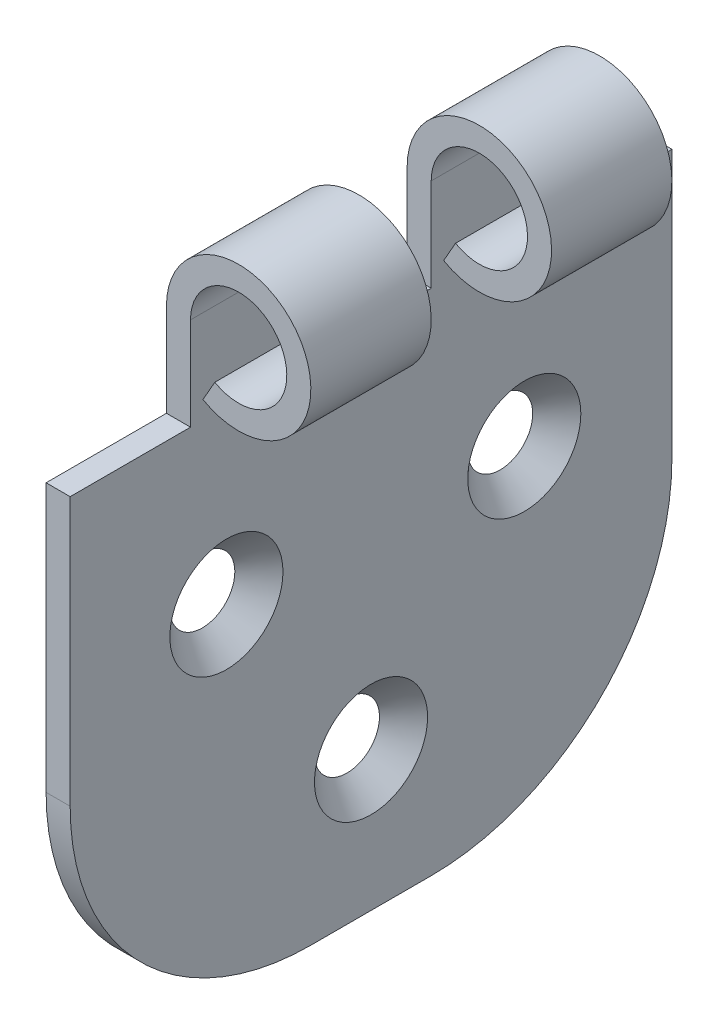
ISO-10303-21;
HEADER;
FILE_DESCRIPTION(('STEP AP214'),'2;1');
FILE_NAME('part.step','',(''),(''),'','','');
FILE_SCHEMA(('AUTOMOTIVE_DESIGN { 1 0 10303 214 1 1 1 1 }'));
ENDSEC;
DATA;
#1=APPLICATION_CONTEXT('core data for automotive mechanical design processes');
#2=APPLICATION_PROTOCOL_DEFINITION('international standard','automotive_design',2000,#1);
#3=PRODUCT_CONTEXT('',#1,'mechanical');
#4=PRODUCT('Part','Part','',(#3));
#5=PRODUCT_RELATED_PRODUCT_CATEGORY('part','',(#4));
#6=PRODUCT_DEFINITION_FORMATION('','',#4);
#7=PRODUCT_DEFINITION_CONTEXT('part definition',#1,'design');
#8=PRODUCT_DEFINITION('design','',#6,#7);
#9=PRODUCT_DEFINITION_SHAPE('','',#8);
#10=(LENGTH_UNIT() NAMED_UNIT(*) SI_UNIT(.MILLI.,.METRE.));
#11=(NAMED_UNIT(*) PLANE_ANGLE_UNIT() SI_UNIT($,.RADIAN.));
#12=(NAMED_UNIT(*) SI_UNIT($,.STERADIAN.) SOLID_ANGLE_UNIT());
#13=UNCERTAINTY_MEASURE_WITH_UNIT(LENGTH_MEASURE(1.E-05),#10,'distance_accuracy_value','');
#14=(GEOMETRIC_REPRESENTATION_CONTEXT(3) GLOBAL_UNCERTAINTY_ASSIGNED_CONTEXT((#13)) GLOBAL_UNIT_ASSIGNED_CONTEXT((#10,
#11,#12)) REPRESENTATION_CONTEXT('',''));
#15=CARTESIAN_POINT('',(0.,0.,0.));
#16=DIRECTION('',(0.,0.,1.));
#17=DIRECTION('',(1.,0.,0.));
#18=AXIS2_PLACEMENT_3D('',#15,#16,#17);
#19=CARTESIAN_POINT('',(1.99999999999999,50.,25.));
#20=DIRECTION('',(-1.,0.,0.));
#21=DIRECTION('',(0.,-1.,0.));
#22=AXIS2_PLACEMENT_3D('',#19,#20,#21);
#23=PLANE('',#22);
#24=CARTESIAN_POINT('',(2.,28.0397626935268,12.0173285585912));
#25=DIRECTION('',(1.,0.,0.));
#26=DIRECTION('',(0.,0.,-1.));
#27=AXIS2_PLACEMENT_3D('',#24,#25,#26);
#28=CIRCLE('',#27,4.7);
#29=CARTESIAN_POINT('',(2.,28.0397626935268,7.3173285585912));
#30=VERTEX_POINT('',#29);
#31=EDGE_CURVE('E304',#30,#30,#28,.T.);
#32=ORIENTED_EDGE('',*,*,#31,.F.);
#33=EDGE_LOOP('',(#32));
#34=FACE_BOUND('',#33,.T.);
#35=CARTESIAN_POINT('',(2.,27.0383186469775,-12.7326457346978));
#36=DIRECTION('',(1.,0.,0.));
#37=DIRECTION('',(0.,0.,-1.));
#38=AXIS2_PLACEMENT_3D('',#35,#36,#37);
#39=CIRCLE('',#38,4.7);
#40=CARTESIAN_POINT('',(2.,27.0383186469775,-17.4326457346978));
#41=VERTEX_POINT('',#40);
#42=EDGE_CURVE('E198',#41,#41,#39,.T.);
#43=ORIENTED_EDGE('',*,*,#42,.F.);
#44=EDGE_LOOP('',(#43));
#45=FACE_BOUND('',#44,.T.);
#46=DIRECTION('',(0.,0.,-1.));
#47=VECTOR('',#46,1.);
#48=CARTESIAN_POINT('',(2.,0.,25.));
#49=LINE('',#48,#47);
#50=CARTESIAN_POINT('',(2.,0.,5.));
#51=VERTEX_POINT('',#50);
#52=CARTESIAN_POINT('',(2.,0.,-5.));
#53=VERTEX_POINT('',#52);
#54=EDGE_CURVE('E279',#51,#53,#49,.T.);
#55=ORIENTED_EDGE('',*,*,#54,.T.);
#56=CARTESIAN_POINT('',(2.,20.,-5.));
#57=DIRECTION('',(-1.,0.,0.));
#58=DIRECTION('',(0.,-1.,0.));
#59=AXIS2_PLACEMENT_3D('',#56,#57,#58);
#60=CIRCLE('',#59,20.);
#61=CARTESIAN_POINT('',(2.,20.,-25.));
#62=VERTEX_POINT('',#61);
#63=EDGE_CURVE('E296',#53,#62,#60,.F.);
#64=ORIENTED_EDGE('',*,*,#63,.T.);
#65=DIRECTION('',(0.,1.,0.));
#66=VECTOR('',#65,1.);
#67=CARTESIAN_POINT('',(1.99999999999999,50.,-25.));
#68=LINE('',#67,#66);
#69=CARTESIAN_POINT('',(1.99999999999999,42.2789868146542,-25.));
#70=VERTEX_POINT('',#69);
#71=EDGE_CURVE('E253',#62,#70,#68,.T.);
#72=ORIENTED_EDGE('',*,*,#71,.T.);
#73=DIRECTION('',(0.,0.,-1.));
#74=VECTOR('',#73,1.);
#75=CARTESIAN_POINT('',(1.99999999999999,42.2789868146542,25.));
#76=LINE('',#75,#74);
#77=CARTESIAN_POINT('',(1.99999999999999,42.2789868146542,-15.));
#78=VERTEX_POINT('',#77);
#79=EDGE_CURVE('E181',#78,#70,#76,.T.);
#80=ORIENTED_EDGE('',*,*,#79,.F.);
#81=DIRECTION('',(0.,-1.,0.));
#82=VECTOR('',#81,1.);
#83=CARTESIAN_POINT('',(1.99999999999999,50.,-15.));
#84=LINE('',#83,#82);
#85=CARTESIAN_POINT('',(1.99999999999999,50.,-15.));
#86=VERTEX_POINT('',#85);
#87=EDGE_CURVE('E226',#86,#78,#84,.T.);
#88=ORIENTED_EDGE('',*,*,#87,.F.);
#89=DIRECTION('',(0.,0.,-1.));
#90=VECTOR('',#89,1.);
#91=CARTESIAN_POINT('',(1.99999999999999,50.,25.));
#92=LINE('',#91,#90);
#93=CARTESIAN_POINT('',(1.99999999999999,50.,-5.));
#94=VERTEX_POINT('',#93);
#95=EDGE_CURVE('E275',#94,#86,#92,.T.);
#96=ORIENTED_EDGE('',*,*,#95,.F.);
#97=DIRECTION('',(0.,1.,0.));
#98=VECTOR('',#97,1.);
#99=CARTESIAN_POINT('',(1.99999999999999,50.,-5.));
#100=LINE('',#99,#98);
#101=CARTESIAN_POINT('',(1.99999999999999,42.2789868146542,-5.));
#102=VERTEX_POINT('',#101);
#103=EDGE_CURVE('E234',#102,#94,#100,.T.);
#104=ORIENTED_EDGE('',*,*,#103,.F.);
#105=DIRECTION('',(0.,0.,-1.));
#106=VECTOR('',#105,1.);
#107=CARTESIAN_POINT('',(1.99999999999999,42.2789868146542,25.));
#108=LINE('',#107,#106);
#109=CARTESIAN_POINT('',(1.99999999999999,42.2789868146542,5.));
#110=VERTEX_POINT('',#109);
#111=EDGE_CURVE('E236',#110,#102,#108,.T.);
#112=ORIENTED_EDGE('',*,*,#111,.F.);
#113=DIRECTION('',(0.,-1.,0.));
#114=VECTOR('',#113,1.);
#115=CARTESIAN_POINT('',(1.99999999999999,50.,5.));
#116=LINE('',#115,#114);
#117=CARTESIAN_POINT('',(1.99999999999999,50.,5.));
#118=VERTEX_POINT('',#117);
#119=EDGE_CURVE('E244',#118,#110,#116,.T.);
#120=ORIENTED_EDGE('',*,*,#119,.F.);
#121=CARTESIAN_POINT('',(1.99999999999999,50.,15.));
#122=VERTEX_POINT('',#121);
#123=EDGE_CURVE('E278',#122,#118,#92,.T.);
#124=ORIENTED_EDGE('',*,*,#123,.F.);
#125=DIRECTION('',(0.,1.,0.));
#126=VECTOR('',#125,1.);
#127=CARTESIAN_POINT('',(1.99999999999999,50.,15.));
#128=LINE('',#127,#126);
#129=CARTESIAN_POINT('',(1.99999999999999,42.2789868146542,15.));
#130=VERTEX_POINT('',#129);
#131=EDGE_CURVE('E251',#130,#122,#128,.T.);
#132=ORIENTED_EDGE('',*,*,#131,.F.);
#133=DIRECTION('',(0.,0.,-1.));
#134=VECTOR('',#133,1.);
#135=CARTESIAN_POINT('',(1.99999999999999,42.2789868146542,25.));
#136=LINE('',#135,#134);
#137=CARTESIAN_POINT('',(2.,42.2789868146542,25.));
#138=VERTEX_POINT('',#137);
#139=EDGE_CURVE('E178',#138,#130,#136,.T.);
#140=ORIENTED_EDGE('',*,*,#139,.F.);
#141=DIRECTION('',(0.,1.,0.));
#142=VECTOR('',#141,1.);
#143=CARTESIAN_POINT('',(1.99999999999999,50.,25.));
#144=LINE('',#143,#142);
#145=CARTESIAN_POINT('',(2.,20.,25.));
#146=VERTEX_POINT('',#145);
#147=EDGE_CURVE('E254',#146,#138,#144,.T.);
#148=ORIENTED_EDGE('',*,*,#147,.F.);
#149=CARTESIAN_POINT('',(2.,20.,5.));
#150=DIRECTION('',(-1.,0.,0.));
#151=DIRECTION('',(0.,-1.,0.));
#152=AXIS2_PLACEMENT_3D('',#149,#150,#151);
#153=CIRCLE('',#152,20.);
#154=EDGE_CURVE('E294',#146,#51,#153,.F.);
#155=ORIENTED_EDGE('',*,*,#154,.T.);
#156=EDGE_LOOP('',(#55,#64,#72,#80,#88,#96,#104,#112,#120,#124,#132,#140,#148,#155));
#157=FACE_BOUND('',#156,.T.);
#158=CARTESIAN_POINT('',(2.,11.5874676430746,0.));
#159=DIRECTION('',(1.,0.,0.));
#160=DIRECTION('',(0.,0.,-1.));
#161=AXIS2_PLACEMENT_3D('',#158,#159,#160);
#162=CIRCLE('',#161,4.7);
#163=CARTESIAN_POINT('',(2.,11.5874676430746,-4.7));
#164=VERTEX_POINT('',#163);
#165=EDGE_CURVE('E312',#164,#164,#162,.T.);
#166=ORIENTED_EDGE('',*,*,#165,.F.);
#167=EDGE_LOOP('',(#166));
#168=FACE_BOUND('',#167,.T.);
#169=ADVANCED_FACE('F40',(#34,#45,#157,#168),#23,.F.);
#170=CARTESIAN_POINT('',(0.,0.,25.));
#171=DIRECTION('',(1.,0.,0.));
#172=DIRECTION('',(0.,0.,-1.));
#173=AXIS2_PLACEMENT_3D('',#170,#171,#172);
#174=PLANE('',#173);
#175=CARTESIAN_POINT('',(0.,11.5874676430746,0.));
#176=DIRECTION('',(1.,0.,0.));
#177=DIRECTION('',(0.,0.,-1.));
#178=AXIS2_PLACEMENT_3D('',#175,#176,#177);
#179=CIRCLE('',#178,2.7);
#180=CARTESIAN_POINT('',(0.,11.5874676430746,-2.7));
#181=VERTEX_POINT('',#180);
#182=EDGE_CURVE('E44',#181,#181,#179,.T.);
#183=ORIENTED_EDGE('',*,*,#182,.T.);
#184=EDGE_LOOP('',(#183));
#185=FACE_BOUND('',#184,.T.);
#186=CARTESIAN_POINT('',(0.,28.0397626935268,12.0173285585912));
#187=DIRECTION('',(1.,0.,0.));
#188=DIRECTION('',(0.,0.,-1.));
#189=AXIS2_PLACEMENT_3D('',#186,#187,#188);
#190=CIRCLE('',#189,2.7);
#191=CARTESIAN_POINT('',(0.,28.0397626935268,9.3173285585912));
#192=VERTEX_POINT('',#191);
#193=EDGE_CURVE('E302',#192,#192,#190,.T.);
#194=ORIENTED_EDGE('',*,*,#193,.T.);
#195=EDGE_LOOP('',(#194));
#196=FACE_BOUND('',#195,.T.);
#197=CARTESIAN_POINT('',(0.,27.0383186469775,-12.7326457346978));
#198=DIRECTION('',(1.,0.,0.));
#199=DIRECTION('',(0.,0.,-1.));
#200=AXIS2_PLACEMENT_3D('',#197,#198,#199);
#201=CIRCLE('',#200,2.7);
#202=CARTESIAN_POINT('',(0.,27.0383186469775,-15.4326457346978));
#203=VERTEX_POINT('',#202);
#204=EDGE_CURVE('E213',#203,#203,#201,.T.);
#205=ORIENTED_EDGE('',*,*,#204,.T.);
#206=EDGE_LOOP('',(#205));
#207=FACE_BOUND('',#206,.T.);
#208=DIRECTION('',(0.,-1.,0.));
#209=VECTOR('',#208,1.);
#210=CARTESIAN_POINT('',(0.,0.,-25.));
#211=LINE('',#210,#209);
#212=CARTESIAN_POINT('',(0.,42.2789868146542,-25.));
#213=VERTEX_POINT('',#212);
#214=CARTESIAN_POINT('',(0.,20.,-25.));
#215=VERTEX_POINT('',#214);
#216=EDGE_CURVE('E256',#213,#215,#211,.T.);
#217=ORIENTED_EDGE('',*,*,#216,.T.);
#218=CARTESIAN_POINT('',(0.,20.,-5.));
#219=DIRECTION('',(1.,0.,0.));
#220=DIRECTION('',(0.,0.,-1.));
#221=AXIS2_PLACEMENT_3D('',#218,#219,#220);
#222=CIRCLE('',#221,20.);
#223=CARTESIAN_POINT('',(0.,0.,-5.));
#224=VERTEX_POINT('',#223);
#225=EDGE_CURVE('E49',#215,#224,#222,.F.);
#226=ORIENTED_EDGE('',*,*,#225,.T.);
#227=DIRECTION('',(0.,0.,-1.));
#228=VECTOR('',#227,1.);
#229=CARTESIAN_POINT('',(0.,0.,25.));
#230=LINE('',#229,#228);
#231=CARTESIAN_POINT('',(0.,0.,5.));
#232=VERTEX_POINT('',#231);
#233=EDGE_CURVE('E258',#232,#224,#230,.T.);
#234=ORIENTED_EDGE('',*,*,#233,.F.);
#235=CARTESIAN_POINT('',(0.,20.,5.));
#236=DIRECTION('',(1.,0.,0.));
#237=DIRECTION('',(0.,0.,-1.));
#238=AXIS2_PLACEMENT_3D('',#235,#236,#237);
#239=CIRCLE('',#238,20.);
#240=CARTESIAN_POINT('',(0.,20.,25.));
#241=VERTEX_POINT('',#240);
#242=EDGE_CURVE('E57',#232,#241,#239,.F.);
#243=ORIENTED_EDGE('',*,*,#242,.T.);
#244=DIRECTION('',(0.,-1.,0.));
#245=VECTOR('',#244,1.);
#246=CARTESIAN_POINT('',(0.,0.,25.));
#247=LINE('',#246,#245);
#248=CARTESIAN_POINT('',(0.,42.2789868146542,25.));
#249=VERTEX_POINT('',#248);
#250=EDGE_CURVE('E192',#249,#241,#247,.T.);
#251=ORIENTED_EDGE('',*,*,#250,.F.);
#252=DIRECTION('',(0.,0.,-1.));
#253=VECTOR('',#252,1.);
#254=CARTESIAN_POINT('',(0.,42.2789868146542,28.1751448411627));
#255=LINE('',#254,#253);
#256=CARTESIAN_POINT('',(0.,42.2789868146542,15.));
#257=VERTEX_POINT('',#256);
#258=EDGE_CURVE('E175',#249,#257,#255,.T.);
#259=ORIENTED_EDGE('',*,*,#258,.T.);
#260=DIRECTION('',(0.,1.,0.));
#261=VECTOR('',#260,1.);
#262=CARTESIAN_POINT('',(0.,61.0425733554984,15.));
#263=LINE('',#262,#261);
#264=CARTESIAN_POINT('',(0.,50.,15.));
#265=VERTEX_POINT('',#264);
#266=EDGE_CURVE('E182',#257,#265,#263,.T.);
#267=ORIENTED_EDGE('',*,*,#266,.T.);
#268=DIRECTION('',(0.,0.,-1.));
#269=VECTOR('',#268,1.);
#270=CARTESIAN_POINT('',(0.,50.,25.));
#271=LINE('',#270,#269);
#272=CARTESIAN_POINT('',(0.,50.,5.));
#273=VERTEX_POINT('',#272);
#274=EDGE_CURVE('E266',#265,#273,#271,.T.);
#275=ORIENTED_EDGE('',*,*,#274,.T.);
#276=DIRECTION('',(0.,1.,0.));
#277=VECTOR('',#276,1.);
#278=CARTESIAN_POINT('',(0.,0.,5.));
#279=LINE('',#278,#277);
#280=CARTESIAN_POINT('',(0.,42.2789868146542,5.));
#281=VERTEX_POINT('',#280);
#282=EDGE_CURVE('E286',#281,#273,#279,.T.);
#283=ORIENTED_EDGE('',*,*,#282,.F.);
#284=DIRECTION('',(0.,0.,-1.));
#285=VECTOR('',#284,1.);
#286=CARTESIAN_POINT('',(0.,42.2789868146542,5.));
#287=LINE('',#286,#285);
#288=CARTESIAN_POINT('',(0.,42.2789868146542,-5.));
#289=VERTEX_POINT('',#288);
#290=EDGE_CURVE('E201',#281,#289,#287,.T.);
#291=ORIENTED_EDGE('',*,*,#290,.T.);
#292=DIRECTION('',(0.,1.,0.));
#293=VECTOR('',#292,1.);
#294=CARTESIAN_POINT('',(0.,61.0425733554984,-5.));
#295=LINE('',#294,#293);
#296=CARTESIAN_POINT('',(0.,50.,-5.));
#297=VERTEX_POINT('',#296);
#298=EDGE_CURVE('E204',#289,#297,#295,.T.);
#299=ORIENTED_EDGE('',*,*,#298,.T.);
#300=CARTESIAN_POINT('',(0.,50.,-15.));
#301=VERTEX_POINT('',#300);
#302=EDGE_CURVE('E263',#297,#301,#271,.T.);
#303=ORIENTED_EDGE('',*,*,#302,.T.);
#304=DIRECTION('',(0.,-1.,0.));
#305=VECTOR('',#304,1.);
#306=CARTESIAN_POINT('',(0.,61.0425733554984,-15.));
#307=LINE('',#306,#305);
#308=CARTESIAN_POINT('',(0.,42.2789868146542,-15.));
#309=VERTEX_POINT('',#308);
#310=EDGE_CURVE('E209',#301,#309,#307,.T.);
#311=ORIENTED_EDGE('',*,*,#310,.T.);
#312=DIRECTION('',(0.,0.,-1.));
#313=VECTOR('',#312,1.);
#314=CARTESIAN_POINT('',(0.,42.2789868146542,-15.));
#315=LINE('',#314,#313);
#316=EDGE_CURVE('E212',#309,#213,#315,.T.);
#317=ORIENTED_EDGE('',*,*,#316,.T.);
#318=EDGE_LOOP('',(#217,#226,#234,#243,#251,#259,#267,#275,#283,#291,#299,#303,#311,#317));
#319=FACE_BOUND('',#318,.T.);
#320=ADVANCED_FACE('F191',(#185,#196,#207,#319),#174,.F.);
#321=CARTESIAN_POINT('',(6.,50.,25.));
#322=DIRECTION('',(0.,0.,-1.));
#323=DIRECTION('',(-1.,0.,0.));
#324=AXIS2_PLACEMENT_3D('',#321,#322,#323);
#325=CYLINDRICAL_SURFACE('',#324,4.00000000000001);
#326=CARTESIAN_POINT('',(6.,50.,15.));
#327=DIRECTION('',(0.,0.,1.));
#328=DIRECTION('',(1.,0.,0.));
#329=AXIS2_PLACEMENT_3D('',#326,#327,#328);
#330=CIRCLE('',#329,4.00000000000001);
#331=CARTESIAN_POINT('',(4.02184665664863,46.5233767316277,15.));
#332=VERTEX_POINT('',#331);
#333=EDGE_CURVE('E249',#122,#332,#330,.F.);
#334=ORIENTED_EDGE('',*,*,#333,.F.);
#335=ORIENTED_EDGE('',*,*,#123,.T.);
#336=CARTESIAN_POINT('',(6.,50.,5.));
#337=DIRECTION('',(0.,0.,-1.));
#338=DIRECTION('',(-1.,0.,0.));
#339=AXIS2_PLACEMENT_3D('',#336,#337,#338);
#340=CIRCLE('',#339,4.00000000000001);
#341=CARTESIAN_POINT('',(4.02184665664863,46.5233767316277,5.));
#342=VERTEX_POINT('',#341);
#343=EDGE_CURVE('E242',#342,#118,#340,.F.);
#344=ORIENTED_EDGE('',*,*,#343,.F.);
#345=DIRECTION('',(0.,0.,-1.));
#346=VECTOR('',#345,1.);
#347=CARTESIAN_POINT('',(4.02184665664862,46.5233767316277,25.));
#348=LINE('',#347,#346);
#349=EDGE_CURVE('E274',#332,#342,#348,.T.);
#350=ORIENTED_EDGE('',*,*,#349,.F.);
#351=EDGE_LOOP('',(#334,#335,#344,#350));
#352=FACE_BOUND('',#351,.T.);
#353=ADVANCED_FACE('F326',(#352),#325,.F.);
#354=CARTESIAN_POINT('',(6.,50.,-5.));
#355=DIRECTION('',(0.,0.,1.));
#356=DIRECTION('',(0.,-1.,0.));
#357=AXIS2_PLACEMENT_3D('',#354,#355,#356);
#358=CIRCLE('',#357,4.00000000000001);
#359=CARTESIAN_POINT('',(4.02184665664863,46.5233767316277,-5.));
#360=VERTEX_POINT('',#359);
#361=EDGE_CURVE('E232',#94,#360,#358,.F.);
#362=ORIENTED_EDGE('',*,*,#361,.F.);
#363=ORIENTED_EDGE('',*,*,#95,.T.);
#364=CARTESIAN_POINT('',(6.,50.,-15.));
#365=DIRECTION('',(0.,0.,-1.));
#366=DIRECTION('',(0.,1.,0.));
#367=AXIS2_PLACEMENT_3D('',#364,#365,#366);
#368=CIRCLE('',#367,4.00000000000001);
#369=CARTESIAN_POINT('',(4.02184665664863,46.5233767316277,-15.));
#370=VERTEX_POINT('',#369);
#371=EDGE_CURVE('E224',#370,#86,#368,.F.);
#372=ORIENTED_EDGE('',*,*,#371,.F.);
#373=EDGE_CURVE('E271',#360,#370,#348,.T.);
#374=ORIENTED_EDGE('',*,*,#373,.F.);
#375=EDGE_LOOP('',(#362,#363,#372,#374));
#376=FACE_BOUND('',#375,.T.);
#377=ADVANCED_FACE('F405',(#376),#325,.F.);
#378=CARTESIAN_POINT('',(3.03276998497294,44.7850650974415,25.));
#379=DIRECTION('',(0.869155817093078,-0.494538335837844,0.));
#380=DIRECTION('',(0.494538335837844,0.869155817093078,0.));
#381=AXIS2_PLACEMENT_3D('',#378,#379,#380);
#382=PLANE('',#381);
#383=DIRECTION('',(-0.494538335837844,-0.869155817093078,0.));
#384=VECTOR('',#383,1.);
#385=CARTESIAN_POINT('',(3.03276998497294,44.7850650974415,15.));
#386=LINE('',#385,#384);
#387=CARTESIAN_POINT('',(3.03276998497294,44.7850650974415,15.));
#388=VERTEX_POINT('',#387);
#389=EDGE_CURVE('E247',#332,#388,#386,.T.);
#390=ORIENTED_EDGE('',*,*,#389,.F.);
#391=ORIENTED_EDGE('',*,*,#349,.T.);
#392=DIRECTION('',(0.494538335837844,0.869155817093078,0.));
#393=VECTOR('',#392,1.);
#394=CARTESIAN_POINT('',(3.03276998497294,44.7850650974415,5.));
#395=LINE('',#394,#393);
#396=CARTESIAN_POINT('',(3.03276998497294,44.7850650974415,5.));
#397=VERTEX_POINT('',#396);
#398=EDGE_CURVE('E240',#397,#342,#395,.T.);
#399=ORIENTED_EDGE('',*,*,#398,.F.);
#400=DIRECTION('',(0.,0.,-1.));
#401=VECTOR('',#400,1.);
#402=CARTESIAN_POINT('',(3.03276998497294,44.7850650974415,25.));
#403=LINE('',#402,#401);
#404=EDGE_CURVE('E270',#388,#397,#403,.T.);
#405=ORIENTED_EDGE('',*,*,#404,.F.);
#406=EDGE_LOOP('',(#390,#391,#399,#405));
#407=FACE_BOUND('',#406,.T.);
#408=ADVANCED_FACE('F371',(#407),#382,.F.);
#409=DIRECTION('',(-0.494538335837844,-0.869155817093078,0.));
#410=VECTOR('',#409,1.);
#411=CARTESIAN_POINT('',(3.03276998497294,44.7850650974415,-5.));
#412=LINE('',#411,#410);
#413=CARTESIAN_POINT('',(3.03276998497294,44.7850650974415,-5.));
#414=VERTEX_POINT('',#413);
#415=EDGE_CURVE('E230',#360,#414,#412,.T.);
#416=ORIENTED_EDGE('',*,*,#415,.F.);
#417=ORIENTED_EDGE('',*,*,#373,.T.);
#418=DIRECTION('',(0.494538335837844,0.869155817093078,0.));
#419=VECTOR('',#418,1.);
#420=CARTESIAN_POINT('',(3.03276998497294,44.7850650974415,-15.));
#421=LINE('',#420,#419);
#422=CARTESIAN_POINT('',(3.03276998497294,44.7850650974415,-15.));
#423=VERTEX_POINT('',#422);
#424=EDGE_CURVE('E222',#423,#370,#421,.T.);
#425=ORIENTED_EDGE('',*,*,#424,.F.);
#426=EDGE_CURVE('E267',#414,#423,#403,.T.);
#427=ORIENTED_EDGE('',*,*,#426,.F.);
#428=EDGE_LOOP('',(#416,#417,#425,#427));
#429=FACE_BOUND('',#428,.T.);
#430=ADVANCED_FACE('F409',(#429),#382,.F.);
#431=CARTESIAN_POINT('',(6.,50.,25.));
#432=DIRECTION('',(0.,0.,-1.));
#433=DIRECTION('',(-1.,0.,0.));
#434=AXIS2_PLACEMENT_3D('',#431,#432,#433);
#435=CYLINDRICAL_SURFACE('',#434,6.);
#436=ORIENTED_EDGE('',*,*,#274,.F.);
#437=CARTESIAN_POINT('',(6.,50.,15.));
#438=DIRECTION('',(0.,0.,1.));
#439=DIRECTION('',(1.,0.,0.));
#440=AXIS2_PLACEMENT_3D('',#437,#438,#439);
#441=CIRCLE('',#440,6.);
#442=EDGE_CURVE('E187',#388,#265,#441,.T.);
#443=ORIENTED_EDGE('',*,*,#442,.F.);
#444=ORIENTED_EDGE('',*,*,#404,.T.);
#445=CARTESIAN_POINT('',(6.,50.,5.));
#446=DIRECTION('',(0.,0.,-1.));
#447=DIRECTION('',(-1.,0.,0.));
#448=AXIS2_PLACEMENT_3D('',#445,#446,#447);
#449=CIRCLE('',#448,6.);
#450=EDGE_CURVE('E238',#273,#397,#449,.T.);
#451=ORIENTED_EDGE('',*,*,#450,.F.);
#452=EDGE_LOOP('',(#436,#443,#444,#451));
#453=FACE_BOUND('',#452,.T.);
#454=ADVANCED_FACE('F375',(#453),#435,.T.);
#455=ORIENTED_EDGE('',*,*,#302,.F.);
#456=CARTESIAN_POINT('',(6.,50.,-5.));
#457=DIRECTION('',(0.,0.,1.));
#458=DIRECTION('',(0.,-1.,0.));
#459=AXIS2_PLACEMENT_3D('',#456,#457,#458);
#460=CIRCLE('',#459,6.);
#461=EDGE_CURVE('E228',#414,#297,#460,.T.);
#462=ORIENTED_EDGE('',*,*,#461,.F.);
#463=ORIENTED_EDGE('',*,*,#426,.T.);
#464=CARTESIAN_POINT('',(6.,50.,-15.));
#465=DIRECTION('',(0.,0.,-1.));
#466=DIRECTION('',(0.,1.,0.));
#467=AXIS2_PLACEMENT_3D('',#464,#465,#466);
#468=CIRCLE('',#467,6.);
#469=EDGE_CURVE('E220',#301,#423,#468,.T.);
#470=ORIENTED_EDGE('',*,*,#469,.F.);
#471=EDGE_LOOP('',(#455,#462,#463,#470));
#472=FACE_BOUND('',#471,.T.);
#473=ADVANCED_FACE('F389',(#472),#435,.T.);
#474=CARTESIAN_POINT('',(6.,50.,25.));
#475=DIRECTION('',(0.,0.,1.));
#476=DIRECTION('',(1.,0.,0.));
#477=AXIS2_PLACEMENT_3D('',#474,#475,#476);
#478=PLANE('',#477);
#479=ORIENTED_EDGE('',*,*,#250,.T.);
#480=DIRECTION('',(1.,0.,0.));
#481=VECTOR('',#480,1.);
#482=CARTESIAN_POINT('',(2.,20.,25.));
#483=LINE('',#482,#481);
#484=EDGE_CURVE('E11',#241,#146,#483,.T.);
#485=ORIENTED_EDGE('',*,*,#484,.T.);
#486=ORIENTED_EDGE('',*,*,#147,.T.);
#487=DIRECTION('',(-1.,0.,0.));
#488=VECTOR('',#487,1.);
#489=CARTESIAN_POINT('',(6.,42.2789868146542,25.));
#490=LINE('',#489,#488);
#491=EDGE_CURVE('E284',#138,#249,#490,.T.);
#492=ORIENTED_EDGE('',*,*,#491,.T.);
#493=EDGE_LOOP('',(#479,#485,#486,#492));
#494=FACE_BOUND('',#493,.T.);
#495=ADVANCED_FACE('F358',(#494),#478,.T.);
#496=CARTESIAN_POINT('',(6.,50.,-25.));
#497=DIRECTION('',(0.,0.,1.));
#498=DIRECTION('',(1.,0.,0.));
#499=AXIS2_PLACEMENT_3D('',#496,#497,#498);
#500=PLANE('',#499);
#501=ORIENTED_EDGE('',*,*,#71,.F.);
#502=DIRECTION('',(1.,0.,0.));
#503=VECTOR('',#502,1.);
#504=CARTESIAN_POINT('',(6.,20.,-25.));
#505=LINE('',#504,#503);
#506=EDGE_CURVE('E65',#62,#215,#505,.F.);
#507=ORIENTED_EDGE('',*,*,#506,.T.);
#508=ORIENTED_EDGE('',*,*,#216,.F.);
#509=DIRECTION('',(-1.,0.,0.));
#510=VECTOR('',#509,1.);
#511=CARTESIAN_POINT('',(6.,42.2789868146542,-25.));
#512=LINE('',#511,#510);
#513=EDGE_CURVE('E282',#70,#213,#512,.T.);
#514=ORIENTED_EDGE('',*,*,#513,.F.);
#515=EDGE_LOOP('',(#501,#507,#508,#514));
#516=FACE_BOUND('',#515,.T.);
#517=ADVANCED_FACE('F336',(#516),#500,.F.);
#518=CARTESIAN_POINT('',(2.,0.,25.));
#519=DIRECTION('',(0.,1.,0.));
#520=DIRECTION('',(-1.,0.,0.));
#521=AXIS2_PLACEMENT_3D('',#518,#519,#520);
#522=PLANE('',#521);
#523=ORIENTED_EDGE('',*,*,#233,.T.);
#524=DIRECTION('',(1.,0.,0.));
#525=VECTOR('',#524,1.);
#526=CARTESIAN_POINT('',(2.,0.,-5.));
#527=LINE('',#526,#525);
#528=EDGE_CURVE('E291',#224,#53,#527,.T.);
#529=ORIENTED_EDGE('',*,*,#528,.T.);
#530=ORIENTED_EDGE('',*,*,#54,.F.);
#531=DIRECTION('',(1.,0.,0.));
#532=VECTOR('',#531,1.);
#533=CARTESIAN_POINT('',(0.,0.,5.));
#534=LINE('',#533,#532);
#535=EDGE_CURVE('E289',#51,#232,#534,.F.);
#536=ORIENTED_EDGE('',*,*,#535,.T.);
#537=EDGE_LOOP('',(#523,#529,#530,#536));
#538=FACE_BOUND('',#537,.T.);
#539=ADVANCED_FACE('F333',(#538),#522,.F.);
#540=CARTESIAN_POINT('',(12.,61.0425733554984,-15.));
#541=DIRECTION('',(0.,0.,-1.));
#542=DIRECTION('',(0.,1.,0.));
#543=AXIS2_PLACEMENT_3D('',#540,#541,#542);
#544=PLANE('',#543);
#545=ORIENTED_EDGE('',*,*,#87,.T.);
#546=DIRECTION('',(-1.,0.,0.));
#547=VECTOR('',#546,1.);
#548=CARTESIAN_POINT('',(12.,42.2789868146542,-15.));
#549=LINE('',#548,#547);
#550=EDGE_CURVE('E205',#78,#309,#549,.T.);
#551=ORIENTED_EDGE('',*,*,#550,.T.);
#552=ORIENTED_EDGE('',*,*,#310,.F.);
#553=ORIENTED_EDGE('',*,*,#469,.T.);
#554=ORIENTED_EDGE('',*,*,#424,.T.);
#555=ORIENTED_EDGE('',*,*,#371,.T.);
#556=EDGE_LOOP('',(#545,#551,#552,#553,#554,#555));
#557=FACE_BOUND('',#556,.T.);
#558=ADVANCED_FACE('F335',(#557),#544,.T.);
#559=CARTESIAN_POINT('',(12.,42.2789868146542,-15.));
#560=DIRECTION('',(0.,1.,0.));
#561=DIRECTION('',(-1.,0.,0.));
#562=AXIS2_PLACEMENT_3D('',#559,#560,#561);
#563=PLANE('',#562);
#564=ORIENTED_EDGE('',*,*,#79,.T.);
#565=ORIENTED_EDGE('',*,*,#513,.T.);
#566=ORIENTED_EDGE('',*,*,#316,.F.);
#567=ORIENTED_EDGE('',*,*,#550,.F.);
#568=EDGE_LOOP('',(#564,#565,#566,#567));
#569=FACE_BOUND('',#568,.T.);
#570=ADVANCED_FACE('F398',(#569),#563,.T.);
#571=CARTESIAN_POINT('',(12.,61.0425733554984,15.));
#572=DIRECTION('',(0.,0.,1.));
#573=DIRECTION('',(1.,0.,0.));
#574=AXIS2_PLACEMENT_3D('',#571,#572,#573);
#575=PLANE('',#574);
#576=ORIENTED_EDGE('',*,*,#131,.T.);
#577=ORIENTED_EDGE('',*,*,#333,.T.);
#578=ORIENTED_EDGE('',*,*,#389,.T.);
#579=ORIENTED_EDGE('',*,*,#442,.T.);
#580=ORIENTED_EDGE('',*,*,#266,.F.);
#581=DIRECTION('',(-1.,0.,0.));
#582=VECTOR('',#581,1.);
#583=CARTESIAN_POINT('',(12.,42.2789868146542,15.));
#584=LINE('',#583,#582);
#585=EDGE_CURVE('E170',#130,#257,#584,.T.);
#586=ORIENTED_EDGE('',*,*,#585,.F.);
#587=EDGE_LOOP('',(#576,#577,#578,#579,#580,#586));
#588=FACE_BOUND('',#587,.T.);
#589=ADVANCED_FACE('F185',(#588),#575,.T.);
#590=CARTESIAN_POINT('',(12.,42.2789868146542,28.1751448411627));
#591=DIRECTION('',(0.,1.,0.));
#592=DIRECTION('',(-1.,0.,0.));
#593=AXIS2_PLACEMENT_3D('',#590,#591,#592);
#594=PLANE('',#593);
#595=ORIENTED_EDGE('',*,*,#139,.T.);
#596=ORIENTED_EDGE('',*,*,#585,.T.);
#597=ORIENTED_EDGE('',*,*,#258,.F.);
#598=ORIENTED_EDGE('',*,*,#491,.F.);
#599=EDGE_LOOP('',(#595,#596,#597,#598));
#600=FACE_BOUND('',#599,.T.);
#601=ADVANCED_FACE('F172',(#600),#594,.T.);
#602=CARTESIAN_POINT('',(12.,61.0425733554984,5.));
#603=DIRECTION('',(0.,0.,-1.));
#604=DIRECTION('',(-1.,0.,0.));
#605=AXIS2_PLACEMENT_3D('',#602,#603,#604);
#606=PLANE('',#605);
#607=ORIENTED_EDGE('',*,*,#119,.T.);
#608=DIRECTION('',(-1.,0.,0.));
#609=VECTOR('',#608,1.);
#610=CARTESIAN_POINT('',(12.,42.2789868146542,5.));
#611=LINE('',#610,#609);
#612=EDGE_CURVE('E193',#110,#281,#611,.T.);
#613=ORIENTED_EDGE('',*,*,#612,.T.);
#614=ORIENTED_EDGE('',*,*,#282,.T.);
#615=ORIENTED_EDGE('',*,*,#450,.T.);
#616=ORIENTED_EDGE('',*,*,#398,.T.);
#617=ORIENTED_EDGE('',*,*,#343,.T.);
#618=EDGE_LOOP('',(#607,#613,#614,#615,#616,#617));
#619=FACE_BOUND('',#618,.T.);
#620=ADVANCED_FACE('F379',(#619),#606,.T.);
#621=CARTESIAN_POINT('',(12.,42.2789868146542,5.));
#622=DIRECTION('',(0.,1.,0.));
#623=DIRECTION('',(-1.,0.,0.));
#624=AXIS2_PLACEMENT_3D('',#621,#622,#623);
#625=PLANE('',#624);
#626=ORIENTED_EDGE('',*,*,#111,.T.);
#627=DIRECTION('',(-1.,0.,0.));
#628=VECTOR('',#627,1.);
#629=CARTESIAN_POINT('',(12.,42.2789868146542,-5.));
#630=LINE('',#629,#628);
#631=EDGE_CURVE('E195',#102,#289,#630,.T.);
#632=ORIENTED_EDGE('',*,*,#631,.T.);
#633=ORIENTED_EDGE('',*,*,#290,.F.);
#634=ORIENTED_EDGE('',*,*,#612,.F.);
#635=EDGE_LOOP('',(#626,#632,#633,#634));
#636=FACE_BOUND('',#635,.T.);
#637=ADVANCED_FACE('F348',(#636),#625,.T.);
#638=CARTESIAN_POINT('',(12.,61.0425733554984,-5.));
#639=DIRECTION('',(0.,0.,1.));
#640=DIRECTION('',(0.,-1.,0.));
#641=AXIS2_PLACEMENT_3D('',#638,#639,#640);
#642=PLANE('',#641);
#643=ORIENTED_EDGE('',*,*,#103,.T.);
#644=ORIENTED_EDGE('',*,*,#361,.T.);
#645=ORIENTED_EDGE('',*,*,#415,.T.);
#646=ORIENTED_EDGE('',*,*,#461,.T.);
#647=ORIENTED_EDGE('',*,*,#298,.F.);
#648=ORIENTED_EDGE('',*,*,#631,.F.);
#649=EDGE_LOOP('',(#643,#644,#645,#646,#647,#648));
#650=FACE_BOUND('',#649,.T.);
#651=ADVANCED_FACE('F340',(#650),#642,.T.);
#652=CARTESIAN_POINT('',(2.,20.,-5.));
#653=DIRECTION('',(1.,0.,0.));
#654=DIRECTION('',(0.,1.,0.));
#655=AXIS2_PLACEMENT_3D('',#652,#653,#654);
#656=CYLINDRICAL_SURFACE('',#655,20.);
#657=ORIENTED_EDGE('',*,*,#225,.F.);
#658=ORIENTED_EDGE('',*,*,#506,.F.);
#659=ORIENTED_EDGE('',*,*,#63,.F.);
#660=ORIENTED_EDGE('',*,*,#528,.F.);
#661=EDGE_LOOP('',(#657,#658,#659,#660));
#662=FACE_BOUND('',#661,.T.);
#663=ADVANCED_FACE('F338',(#662),#656,.T.);
#664=CARTESIAN_POINT('',(6.,20.,5.));
#665=DIRECTION('',(-1.,0.,0.));
#666=DIRECTION('',(0.,-1.,0.));
#667=AXIS2_PLACEMENT_3D('',#664,#665,#666);
#668=CYLINDRICAL_SURFACE('',#667,20.);
#669=ORIENTED_EDGE('',*,*,#242,.F.);
#670=ORIENTED_EDGE('',*,*,#535,.F.);
#671=ORIENTED_EDGE('',*,*,#154,.F.);
#672=ORIENTED_EDGE('',*,*,#484,.F.);
#673=EDGE_LOOP('',(#669,#670,#671,#672));
#674=FACE_BOUND('',#673,.T.);
#675=ADVANCED_FACE('F42',(#674),#668,.T.);
#676=CARTESIAN_POINT('',(2.,27.0383186469775,-12.7326457346978));
#677=DIRECTION('',(1.,0.,0.));
#678=DIRECTION('',(0.,0.,-1.));
#679=AXIS2_PLACEMENT_3D('',#676,#677,#678);
#680=CONICAL_SURFACE('',#679,4.7,0.785398163397448);
#681=ORIENTED_EDGE('',*,*,#42,.T.);
#682=EDGE_LOOP('',(#681));
#683=FACE_BOUND('',#682,.T.);
#684=ORIENTED_EDGE('',*,*,#204,.F.);
#685=EDGE_LOOP('',(#684));
#686=FACE_BOUND('',#685,.T.);
#687=ADVANCED_FACE('F346',(#683,#686),#680,.F.);
#688=CARTESIAN_POINT('',(2.,28.0397626935268,12.0173285585912));
#689=DIRECTION('',(1.,0.,0.));
#690=DIRECTION('',(0.,0.,-1.));
#691=AXIS2_PLACEMENT_3D('',#688,#689,#690);
#692=CONICAL_SURFACE('',#691,4.7,0.785398163397448);
#693=ORIENTED_EDGE('',*,*,#31,.T.);
#694=EDGE_LOOP('',(#693));
#695=FACE_BOUND('',#694,.T.);
#696=ORIENTED_EDGE('',*,*,#193,.F.);
#697=EDGE_LOOP('',(#696));
#698=FACE_BOUND('',#697,.T.);
#699=ADVANCED_FACE('F435',(#695,#698),#692,.F.);
#700=CARTESIAN_POINT('',(2.,11.5874676430746,0.));
#701=DIRECTION('',(1.,0.,0.));
#702=DIRECTION('',(0.,0.,-1.));
#703=AXIS2_PLACEMENT_3D('',#700,#701,#702);
#704=CONICAL_SURFACE('',#703,4.7,0.785398163397448);
#705=ORIENTED_EDGE('',*,*,#165,.T.);
#706=EDGE_LOOP('',(#705));
#707=FACE_BOUND('',#706,.T.);
#708=ORIENTED_EDGE('',*,*,#182,.F.);
#709=EDGE_LOOP('',(#708));
#710=FACE_BOUND('',#709,.T.);
#711=ADVANCED_FACE('F317',(#707,#710),#704,.F.);
#712=CLOSED_SHELL('',(#169,#320,#353,#377,#408,#430,#454,#473,#495,#517,#539,#558,#570,#589,
#601,#620,#637,#651,#663,#675,#687,#699,#711));
#713=MANIFOLD_SOLID_BREP('B2',#712);
#714=ADVANCED_BREP_SHAPE_REPRESENTATION('',(#18,#713),#14);
#715=SHAPE_DEFINITION_REPRESENTATION(#9,#714);
ENDSEC;
END-ISO-10303-21;
